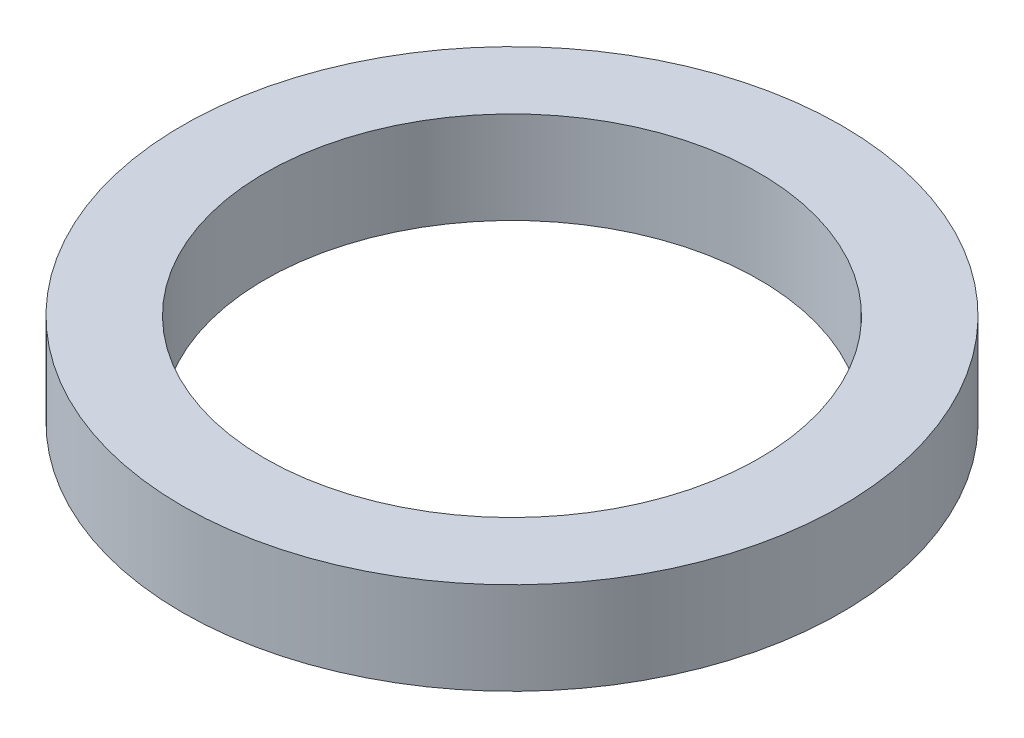
ISO-10303-21;
HEADER;
FILE_DESCRIPTION(('STEP AP214'),'2;1');
FILE_NAME('part.step','',(''),(''),'','','');
FILE_SCHEMA(('AUTOMOTIVE_DESIGN { 1 0 10303 214 1 1 1 1 }'));
ENDSEC;
DATA;
#1=APPLICATION_CONTEXT('core data for automotive mechanical design processes');
#2=APPLICATION_PROTOCOL_DEFINITION('international standard','automotive_design',2000,#1);
#3=PRODUCT_CONTEXT('',#1,'mechanical');
#4=PRODUCT('Part','Part','',(#3));
#5=PRODUCT_RELATED_PRODUCT_CATEGORY('part','',(#4));
#6=PRODUCT_DEFINITION_FORMATION('','',#4);
#7=PRODUCT_DEFINITION_CONTEXT('part definition',#1,'design');
#8=PRODUCT_DEFINITION('design','',#6,#7);
#9=PRODUCT_DEFINITION_SHAPE('','',#8);
#10=(LENGTH_UNIT() NAMED_UNIT(*) SI_UNIT(.MILLI.,.METRE.));
#11=(NAMED_UNIT(*) PLANE_ANGLE_UNIT() SI_UNIT($,.RADIAN.));
#12=(NAMED_UNIT(*) SI_UNIT($,.STERADIAN.) SOLID_ANGLE_UNIT());
#13=UNCERTAINTY_MEASURE_WITH_UNIT(LENGTH_MEASURE(1.E-05),#10,'distance_accuracy_value','');
#14=(GEOMETRIC_REPRESENTATION_CONTEXT(3) GLOBAL_UNCERTAINTY_ASSIGNED_CONTEXT((#13)) GLOBAL_UNIT_ASSIGNED_CONTEXT((#10,
#11,#12)) REPRESENTATION_CONTEXT('',''));
#15=CARTESIAN_POINT('',(0.,0.,0.));
#16=DIRECTION('',(0.,0.,1.));
#17=DIRECTION('',(1.,0.,0.));
#18=AXIS2_PLACEMENT_3D('',#15,#16,#17);
#19=CARTESIAN_POINT('',(0.,14.,0.));
#20=DIRECTION('',(0.,-1.,0.));
#21=DIRECTION('',(0.,0.,-1.));
#22=AXIS2_PLACEMENT_3D('',#19,#20,#21);
#23=CYLINDRICAL_SURFACE('',#22,50.);
#24=CARTESIAN_POINT('',(0.,14.,0.));
#25=DIRECTION('',(0.,1.,0.));
#26=DIRECTION('',(0.,0.,1.));
#27=AXIS2_PLACEMENT_3D('',#24,#25,#26);
#28=CIRCLE('',#27,50.);
#29=CARTESIAN_POINT('',(0.,14.,50.));
#30=VERTEX_POINT('',#29);
#31=EDGE_CURVE('E10',#30,#30,#28,.T.);
#32=ORIENTED_EDGE('',*,*,#31,.F.);
#33=EDGE_LOOP('',(#32));
#34=FACE_BOUND('',#33,.T.);
#35=CARTESIAN_POINT('',(0.,0.,0.));
#36=DIRECTION('',(0.,1.,0.));
#37=DIRECTION('',(0.,0.,1.));
#38=AXIS2_PLACEMENT_3D('',#35,#36,#37);
#39=CIRCLE('',#38,50.);
#40=CARTESIAN_POINT('',(0.,0.,50.));
#41=VERTEX_POINT('',#40);
#42=EDGE_CURVE('E37',#41,#41,#39,.T.);
#43=ORIENTED_EDGE('',*,*,#42,.T.);
#44=EDGE_LOOP('',(#43));
#45=FACE_BOUND('',#44,.T.);
#46=ADVANCED_FACE('F40',(#34,#45),#23,.T.);
#47=CARTESIAN_POINT('',(0.,14.,0.));
#48=DIRECTION('',(0.,1.,0.));
#49=DIRECTION('',(0.,0.,1.));
#50=AXIS2_PLACEMENT_3D('',#47,#48,#49);
#51=PLANE('',#50);
#52=CARTESIAN_POINT('',(0.,14.,0.));
#53=DIRECTION('',(0.,1.,0.));
#54=DIRECTION('',(0.,0.,1.));
#55=AXIS2_PLACEMENT_3D('',#52,#53,#54);
#56=CIRCLE('',#55,37.5);
#57=CARTESIAN_POINT('',(0.,14.,37.5));
#58=VERTEX_POINT('',#57);
#59=EDGE_CURVE('E50',#58,#58,#56,.T.);
#60=ORIENTED_EDGE('',*,*,#59,.F.);
#61=EDGE_LOOP('',(#60));
#62=FACE_BOUND('',#61,.T.);
#63=ORIENTED_EDGE('',*,*,#31,.T.);
#64=EDGE_LOOP('',(#63));
#65=FACE_BOUND('',#64,.T.);
#66=ADVANCED_FACE('F59',(#62,#65),#51,.T.);
#67=CARTESIAN_POINT('',(0.,0.,0.));
#68=DIRECTION('',(0.,1.,0.));
#69=DIRECTION('',(0.,0.,1.));
#70=AXIS2_PLACEMENT_3D('',#67,#68,#69);
#71=PLANE('',#70);
#72=CARTESIAN_POINT('',(0.,0.,0.));
#73=DIRECTION('',(0.,1.,0.));
#74=DIRECTION('',(0.,0.,1.));
#75=AXIS2_PLACEMENT_3D('',#72,#73,#74);
#76=CIRCLE('',#75,37.5);
#77=CARTESIAN_POINT('',(0.,0.,37.5));
#78=VERTEX_POINT('',#77);
#79=EDGE_CURVE('E47',#78,#78,#76,.T.);
#80=ORIENTED_EDGE('',*,*,#79,.T.);
#81=EDGE_LOOP('',(#80));
#82=FACE_BOUND('',#81,.T.);
#83=ORIENTED_EDGE('',*,*,#42,.F.);
#84=EDGE_LOOP('',(#83));
#85=FACE_BOUND('',#84,.T.);
#86=ADVANCED_FACE('F58',(#82,#85),#71,.F.);
#87=CARTESIAN_POINT('',(0.,14.,0.));
#88=DIRECTION('',(0.,-1.,0.));
#89=DIRECTION('',(0.,0.,-1.));
#90=AXIS2_PLACEMENT_3D('',#87,#88,#89);
#91=CYLINDRICAL_SURFACE('',#90,37.5);
#92=ORIENTED_EDGE('',*,*,#59,.T.);
#93=EDGE_LOOP('',(#92));
#94=FACE_BOUND('',#93,.T.);
#95=ORIENTED_EDGE('',*,*,#79,.F.);
#96=EDGE_LOOP('',(#95));
#97=FACE_BOUND('',#96,.T.);
#98=ADVANCED_FACE('F54',(#94,#97),#91,.F.);
#99=CLOSED_SHELL('',(#46,#66,#86,#98));
#100=MANIFOLD_SOLID_BREP('B2',#99);
#101=ADVANCED_BREP_SHAPE_REPRESENTATION('',(#18,#100),#14);
#102=SHAPE_DEFINITION_REPRESENTATION(#9,#101);
ENDSEC;
END-ISO-10303-21;
